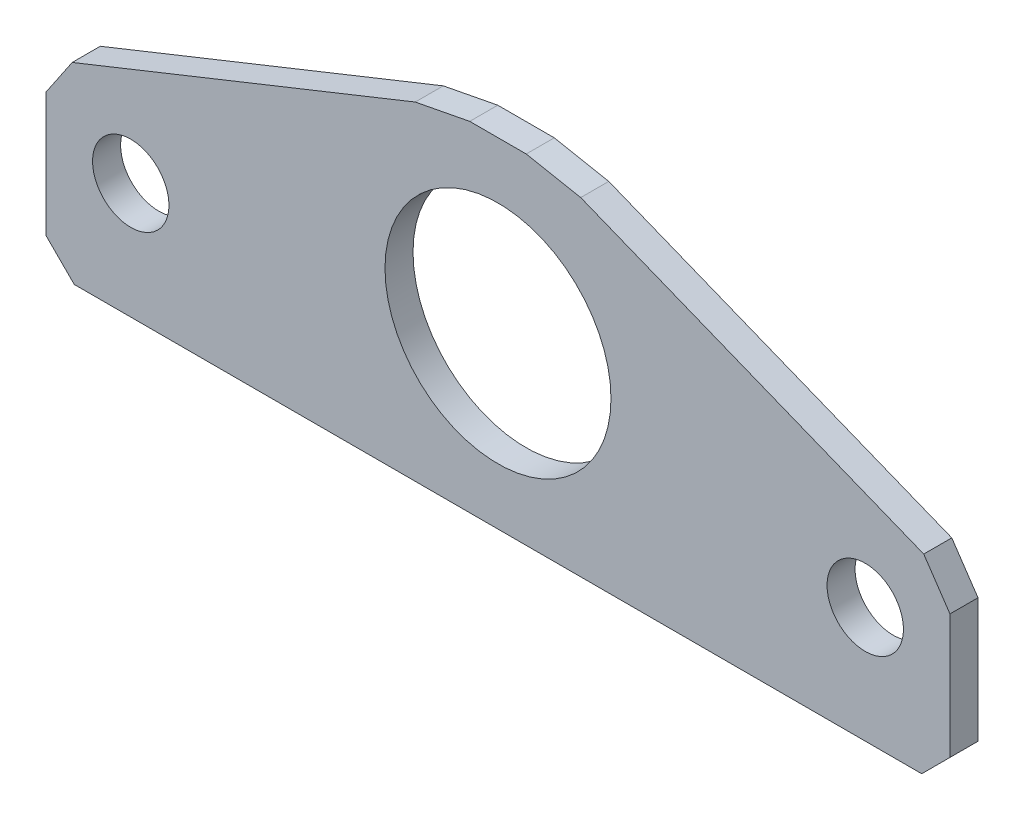
ISO-10303-21;
HEADER;
FILE_DESCRIPTION(('STEP AP214'),'2;1');
FILE_NAME('part.step','',(''),(''),'','','');
FILE_SCHEMA(('AUTOMOTIVE_DESIGN { 1 0 10303 214 1 1 1 1 }'));
ENDSEC;
DATA;
#1=APPLICATION_CONTEXT('core data for automotive mechanical design processes');
#2=APPLICATION_PROTOCOL_DEFINITION('international standard','automotive_design',2000,#1);
#3=PRODUCT_CONTEXT('',#1,'mechanical');
#4=PRODUCT('Part','Part','',(#3));
#5=PRODUCT_RELATED_PRODUCT_CATEGORY('part','',(#4));
#6=PRODUCT_DEFINITION_FORMATION('','',#4);
#7=PRODUCT_DEFINITION_CONTEXT('part definition',#1,'design');
#8=PRODUCT_DEFINITION('design','',#6,#7);
#9=PRODUCT_DEFINITION_SHAPE('','',#8);
#10=(LENGTH_UNIT() NAMED_UNIT(*) SI_UNIT(.MILLI.,.METRE.));
#11=(NAMED_UNIT(*) PLANE_ANGLE_UNIT() SI_UNIT($,.RADIAN.));
#12=(NAMED_UNIT(*) SI_UNIT($,.STERADIAN.) SOLID_ANGLE_UNIT());
#13=UNCERTAINTY_MEASURE_WITH_UNIT(LENGTH_MEASURE(1.E-05),#10,'distance_accuracy_value','');
#14=(GEOMETRIC_REPRESENTATION_CONTEXT(3) GLOBAL_UNCERTAINTY_ASSIGNED_CONTEXT((#13)) GLOBAL_UNIT_ASSIGNED_CONTEXT((#10,
#11,#12)) REPRESENTATION_CONTEXT('',''));
#15=CARTESIAN_POINT('',(0.,0.,0.));
#16=DIRECTION('',(0.,0.,1.));
#17=DIRECTION('',(1.,0.,0.));
#18=AXIS2_PLACEMENT_3D('',#15,#16,#17);
#19=CARTESIAN_POINT('',(25.4,20.955,1.5748));
#20=DIRECTION('',(0.,0.,-1.));
#21=DIRECTION('',(-1.,0.,0.));
#22=AXIS2_PLACEMENT_3D('',#19,#20,#21);
#23=PLANE('',#22);
#24=CARTESIAN_POINT('',(0.,0.,1.5748));
#25=DIRECTION('',(0.,0.,-1.));
#26=DIRECTION('',(-1.,0.,0.));
#27=AXIS2_PLACEMENT_3D('',#24,#25,#26);
#28=CIRCLE('',#27,6.35);
#29=CARTESIAN_POINT('',(-6.35,0.,1.5748));
#30=VERTEX_POINT('',#29);
#31=EDGE_CURVE('E137',#30,#30,#28,.T.);
#32=ORIENTED_EDGE('',*,*,#31,.T.);
#33=EDGE_LOOP('',(#32));
#34=FACE_BOUND('',#33,.T.);
#35=CARTESIAN_POINT('',(20.6375,-3.01285020999999,1.5748));
#36=DIRECTION('',(0.,0.,-1.));
#37=DIRECTION('',(-1.,0.,0.));
#38=AXIS2_PLACEMENT_3D('',#35,#36,#37);
#39=CIRCLE('',#38,2.1463);
#40=CARTESIAN_POINT('',(18.4912,-3.01285020999999,1.5748));
#41=VERTEX_POINT('',#40);
#42=EDGE_CURVE('E139',#41,#41,#39,.T.);
#43=ORIENTED_EDGE('',*,*,#42,.T.);
#44=EDGE_LOOP('',(#43));
#45=FACE_BOUND('',#44,.T.);
#46=DIRECTION('',(0.560628809305184,0.828067230469273,0.));
#47=VECTOR('',#46,1.);
#48=CARTESIAN_POINT('',(-25.4,-0.952500000000011,1.5748));
#49=LINE('',#48,#47);
#50=CARTESIAN_POINT('',(-23.9260432532196,1.22458269871215,1.5748));
#51=VERTEX_POINT('',#50);
#52=CARTESIAN_POINT('',(-25.4,-0.952500000000013,1.5748));
#53=VERTEX_POINT('',#52);
#54=EDGE_CURVE('E118',#51,#53,#49,.F.);
#55=ORIENTED_EDGE('',*,*,#54,.T.);
#56=DIRECTION('',(0.,1.,0.));
#57=VECTOR('',#56,1.);
#58=CARTESIAN_POINT('',(-25.4,0.635,1.5748));
#59=LINE('',#58,#57);
#60=CARTESIAN_POINT('',(-25.4,-7.9375,1.5748));
#61=VERTEX_POINT('',#60);
#62=EDGE_CURVE('E108',#53,#61,#59,.F.);
#63=ORIENTED_EDGE('',*,*,#62,.T.);
#64=DIRECTION('',(-0.707106781186547,0.707106781186548,0.));
#65=VECTOR('',#64,1.);
#66=CARTESIAN_POINT('',(-23.8125,-9.525,1.5748));
#67=LINE('',#66,#65);
#68=CARTESIAN_POINT('',(-23.8125,-9.525,1.5748));
#69=VERTEX_POINT('',#68);
#70=EDGE_CURVE('E141',#61,#69,#67,.F.);
#71=ORIENTED_EDGE('',*,*,#70,.T.);
#72=DIRECTION('',(-1.,0.,0.));
#73=VECTOR('',#72,1.);
#74=CARTESIAN_POINT('',(-25.4,-9.525,1.5748));
#75=LINE('',#74,#73);
#76=CARTESIAN_POINT('',(23.8125,-9.525,1.5748));
#77=VERTEX_POINT('',#76);
#78=EDGE_CURVE('E151',#69,#77,#75,.F.);
#79=ORIENTED_EDGE('',*,*,#78,.T.);
#80=DIRECTION('',(-0.707106781186547,-0.707106781186548,0.));
#81=VECTOR('',#80,1.);
#82=CARTESIAN_POINT('',(25.4,-7.93749999999999,1.5748));
#83=LINE('',#82,#81);
#84=CARTESIAN_POINT('',(25.4,-7.93749999999999,1.5748));
#85=VERTEX_POINT('',#84);
#86=EDGE_CURVE('E155',#77,#85,#83,.F.);
#87=ORIENTED_EDGE('',*,*,#86,.T.);
#88=DIRECTION('',(0.,-1.,0.));
#89=VECTOR('',#88,1.);
#90=CARTESIAN_POINT('',(25.4,0.635000000000006,1.5748));
#91=LINE('',#90,#89);
#92=CARTESIAN_POINT('',(25.4,-0.952500000000007,1.5748));
#93=VERTEX_POINT('',#92);
#94=EDGE_CURVE('E160',#85,#93,#91,.F.);
#95=ORIENTED_EDGE('',*,*,#94,.T.);
#96=DIRECTION('',(0.560628809305184,-0.828067230469273,0.));
#97=VECTOR('',#96,1.);
#98=CARTESIAN_POINT('',(23.9260432532196,1.22458269871215,1.5748));
#99=LINE('',#98,#97);
#100=CARTESIAN_POINT('',(23.9260432532196,1.22458269871215,1.5748));
#101=VERTEX_POINT('',#100);
#102=EDGE_CURVE('E165',#93,#101,#99,.F.);
#103=ORIENTED_EDGE('',*,*,#102,.T.);
#104=DIRECTION('',(0.928476690885259,-0.371390676354104,0.));
#105=VECTOR('',#104,1.);
#106=CARTESIAN_POINT('',(25.4,0.635000000000006,1.5748));
#107=LINE('',#106,#105);
#108=CARTESIAN_POINT('',(4.64895674678047,8.93541730128782,1.5748));
#109=VERTEX_POINT('',#108);
#110=EDGE_CURVE('E170',#101,#109,#107,.F.);
#111=ORIENTED_EDGE('',*,*,#110,.T.);
#112=DIRECTION('',(0.981956386731422,-0.189107521154951,0.));
#113=VECTOR('',#112,1.);
#114=CARTESIAN_POINT('',(1.58749999999997,9.525,1.5748));
#115=LINE('',#114,#113);
#116=CARTESIAN_POINT('',(1.58749999999986,9.525,1.5748));
#117=VERTEX_POINT('',#116);
#118=EDGE_CURVE('E175',#109,#117,#115,.F.);
#119=ORIENTED_EDGE('',*,*,#118,.T.);
#120=DIRECTION('',(1.,0.,0.));
#121=VECTOR('',#120,1.);
#122=CARTESIAN_POINT('',(-3.175,9.525,1.5748));
#123=LINE('',#122,#121);
#124=CARTESIAN_POINT('',(-1.58749999999997,9.525,1.5748));
#125=VERTEX_POINT('',#124);
#126=EDGE_CURVE('E180',#117,#125,#123,.F.);
#127=ORIENTED_EDGE('',*,*,#126,.T.);
#128=DIRECTION('',(0.981956386731422,0.189107521154951,0.));
#129=VECTOR('',#128,1.);
#130=CARTESIAN_POINT('',(-4.64895674678038,8.93541730128785,1.5748));
#131=LINE('',#130,#129);
#132=CARTESIAN_POINT('',(-4.64895674678053,8.93541730128779,1.5748));
#133=VERTEX_POINT('',#132);
#134=EDGE_CURVE('E185',#125,#133,#131,.F.);
#135=ORIENTED_EDGE('',*,*,#134,.T.);
#136=DIRECTION('',(0.928476690885259,0.371390676354104,0.));
#137=VECTOR('',#136,1.);
#138=CARTESIAN_POINT('',(-25.4,0.635,1.5748));
#139=LINE('',#138,#137);
#140=EDGE_CURVE('E103',#133,#51,#139,.F.);
#141=ORIENTED_EDGE('',*,*,#140,.T.);
#142=EDGE_LOOP('',(#55,#63,#71,#79,#87,#95,#103,#111,#119,#127,#135,#141));
#143=FACE_BOUND('',#142,.T.);
#144=CARTESIAN_POINT('',(-20.6375,-3.01285021,1.5748));
#145=DIRECTION('',(0.,0.,-1.));
#146=DIRECTION('',(-1.,0.,0.));
#147=AXIS2_PLACEMENT_3D('',#144,#145,#146);
#148=CIRCLE('',#147,2.1463);
#149=CARTESIAN_POINT('',(-22.7838,-3.01285021,1.5748));
#150=VERTEX_POINT('',#149);
#151=EDGE_CURVE('E20',#150,#150,#148,.T.);
#152=ORIENTED_EDGE('',*,*,#151,.T.);
#153=EDGE_LOOP('',(#152));
#154=FACE_BOUND('',#153,.T.);
#155=ADVANCED_FACE('F17',(#34,#45,#143,#154),#23,.F.);
#156=CARTESIAN_POINT('',(-20.6375,-3.01285021,1.5748));
#157=DIRECTION('',(0.,0.,-1.));
#158=DIRECTION('',(-1.,0.,0.));
#159=AXIS2_PLACEMENT_3D('',#156,#157,#158);
#160=CYLINDRICAL_SURFACE('',#159,2.1463);
#161=ORIENTED_EDGE('',*,*,#151,.F.);
#162=EDGE_LOOP('',(#161));
#163=FACE_BOUND('',#162,.T.);
#164=CARTESIAN_POINT('',(-20.6375,-3.01285021,0.));
#165=DIRECTION('',(0.,0.,-1.));
#166=DIRECTION('',(-1.,0.,0.));
#167=AXIS2_PLACEMENT_3D('',#164,#165,#166);
#168=CIRCLE('',#167,2.1463);
#169=CARTESIAN_POINT('',(-22.7838,-3.01285021,0.));
#170=VERTEX_POINT('',#169);
#171=EDGE_CURVE('E133',#170,#170,#168,.F.);
#172=ORIENTED_EDGE('',*,*,#171,.F.);
#173=EDGE_LOOP('',(#172));
#174=FACE_BOUND('',#173,.T.);
#175=ADVANCED_FACE('F261',(#163,#174),#160,.F.);
#176=CARTESIAN_POINT('',(-25.4,0.635,1.5748));
#177=DIRECTION('',(1.,0.,0.));
#178=DIRECTION('',(0.,0.,-1.));
#179=AXIS2_PLACEMENT_3D('',#176,#177,#178);
#180=PLANE('',#179);
#181=DIRECTION('',(0.,0.,1.));
#182=VECTOR('',#181,1.);
#183=CARTESIAN_POINT('',(-25.4,-0.952500000000011,1.5748));
#184=LINE('',#183,#182);
#185=CARTESIAN_POINT('',(-25.4,-0.952500000000016,0.));
#186=VERTEX_POINT('',#185);
#187=EDGE_CURVE('E111',#53,#186,#184,.F.);
#188=ORIENTED_EDGE('',*,*,#187,.T.);
#189=DIRECTION('',(0.,1.,0.));
#190=VECTOR('',#189,1.);
#191=CARTESIAN_POINT('',(-25.4,20.955,0.));
#192=LINE('',#191,#190);
#193=CARTESIAN_POINT('',(-25.4,-7.9375,0.));
#194=VERTEX_POINT('',#193);
#195=EDGE_CURVE('E136',#194,#186,#192,.T.);
#196=ORIENTED_EDGE('',*,*,#195,.F.);
#197=DIRECTION('',(0.,0.,1.));
#198=VECTOR('',#197,1.);
#199=CARTESIAN_POINT('',(-25.4,-7.9375,1.5748));
#200=LINE('',#199,#198);
#201=EDGE_CURVE('E114',#194,#61,#200,.T.);
#202=ORIENTED_EDGE('',*,*,#201,.T.);
#203=ORIENTED_EDGE('',*,*,#62,.F.);
#204=EDGE_LOOP('',(#188,#196,#202,#203));
#205=FACE_BOUND('',#204,.T.);
#206=ADVANCED_FACE('F109',(#205),#180,.F.);
#207=CARTESIAN_POINT('',(-25.4,-0.952500000000011,1.5748));
#208=DIRECTION('',(0.828067230469273,-0.560628809305184,0.));
#209=DIRECTION('',(0.560628809305184,0.828067230469273,0.));
#210=AXIS2_PLACEMENT_3D('',#207,#208,#209);
#211=PLANE('',#210);
#212=DIRECTION('',(0.,0.,1.));
#213=VECTOR('',#212,1.);
#214=CARTESIAN_POINT('',(-23.9260432532196,1.22458269871215,1.5748));
#215=LINE('',#214,#213);
#216=CARTESIAN_POINT('',(-23.9260432532196,1.22458269871215,0.));
#217=VERTEX_POINT('',#216);
#218=EDGE_CURVE('E189',#51,#217,#215,.F.);
#219=ORIENTED_EDGE('',*,*,#218,.T.);
#220=DIRECTION('',(0.560628809305186,0.828067230469271,0.));
#221=VECTOR('',#220,1.);
#222=CARTESIAN_POINT('',(-25.4,-0.952500000000016,0.));
#223=LINE('',#222,#221);
#224=EDGE_CURVE('E125',#186,#217,#223,.T.);
#225=ORIENTED_EDGE('',*,*,#224,.F.);
#226=ORIENTED_EDGE('',*,*,#187,.F.);
#227=ORIENTED_EDGE('',*,*,#54,.F.);
#228=EDGE_LOOP('',(#219,#225,#226,#227));
#229=FACE_BOUND('',#228,.T.);
#230=ADVANCED_FACE('F123',(#229),#211,.F.);
#231=CARTESIAN_POINT('',(-25.4,0.635,1.5748));
#232=DIRECTION('',(0.371390676354104,-0.928476690885259,0.));
#233=DIRECTION('',(0.928476690885259,0.371390676354104,0.));
#234=AXIS2_PLACEMENT_3D('',#231,#232,#233);
#235=PLANE('',#234);
#236=ORIENTED_EDGE('',*,*,#218,.F.);
#237=ORIENTED_EDGE('',*,*,#140,.F.);
#238=DIRECTION('',(0.,0.,1.));
#239=VECTOR('',#238,1.);
#240=CARTESIAN_POINT('',(-4.64895674678036,8.93541730128785,1.5748));
#241=LINE('',#240,#239);
#242=CARTESIAN_POINT('',(-4.6489567467806,8.93541730128777,0.));
#243=VERTEX_POINT('',#242);
#244=EDGE_CURVE('E187',#133,#243,#241,.F.);
#245=ORIENTED_EDGE('',*,*,#244,.T.);
#246=DIRECTION('',(0.928476690885259,0.371390676354105,0.));
#247=VECTOR('',#246,1.);
#248=CARTESIAN_POINT('',(-23.9260432532196,1.22458269871215,0.));
#249=LINE('',#248,#247);
#250=EDGE_CURVE('E193',#217,#243,#249,.T.);
#251=ORIENTED_EDGE('',*,*,#250,.F.);
#252=EDGE_LOOP('',(#236,#237,#245,#251));
#253=FACE_BOUND('',#252,.T.);
#254=ADVANCED_FACE('F194',(#253),#235,.F.);
#255=CARTESIAN_POINT('',(-4.64895674678038,8.93541730128785,1.5748));
#256=DIRECTION('',(0.189107521154951,-0.981956386731422,0.));
#257=DIRECTION('',(0.981956386731422,0.189107521154951,0.));
#258=AXIS2_PLACEMENT_3D('',#255,#256,#257);
#259=PLANE('',#258);
#260=DIRECTION('',(0.,0.,-1.));
#261=VECTOR('',#260,1.);
#262=CARTESIAN_POINT('',(-1.58749999999998,9.525,1.5748));
#263=LINE('',#262,#261);
#264=CARTESIAN_POINT('',(-1.58749999999997,9.525,0.));
#265=VERTEX_POINT('',#264);
#266=EDGE_CURVE('E183',#125,#265,#263,.T.);
#267=ORIENTED_EDGE('',*,*,#266,.T.);
#268=DIRECTION('',(0.98195638673142,0.189107521154962,0.));
#269=VECTOR('',#268,1.);
#270=CARTESIAN_POINT('',(-4.64895674678072,8.93541730128775,0.));
#271=LINE('',#270,#269);
#272=EDGE_CURVE('E199',#243,#265,#271,.T.);
#273=ORIENTED_EDGE('',*,*,#272,.F.);
#274=ORIENTED_EDGE('',*,*,#244,.F.);
#275=ORIENTED_EDGE('',*,*,#134,.F.);
#276=EDGE_LOOP('',(#267,#273,#274,#275));
#277=FACE_BOUND('',#276,.T.);
#278=ADVANCED_FACE('F277',(#277),#259,.F.);
#279=CARTESIAN_POINT('',(-3.175,9.525,1.5748));
#280=DIRECTION('',(0.,-1.,0.));
#281=DIRECTION('',(0.,0.,-1.));
#282=AXIS2_PLACEMENT_3D('',#279,#280,#281);
#283=PLANE('',#282);
#284=DIRECTION('',(0.,0.,1.));
#285=VECTOR('',#284,1.);
#286=CARTESIAN_POINT('',(1.58749999999994,9.52500000000001,1.5748));
#287=LINE('',#286,#285);
#288=CARTESIAN_POINT('',(1.58749999999984,9.525,0.));
#289=VERTEX_POINT('',#288);
#290=EDGE_CURVE('E178',#117,#289,#287,.F.);
#291=ORIENTED_EDGE('',*,*,#290,.T.);
#292=DIRECTION('',(-1.,0.,0.));
#293=VECTOR('',#292,1.);
#294=CARTESIAN_POINT('',(25.4,9.525,0.));
#295=LINE('',#294,#293);
#296=EDGE_CURVE('E207',#265,#289,#295,.F.);
#297=ORIENTED_EDGE('',*,*,#296,.F.);
#298=ORIENTED_EDGE('',*,*,#266,.F.);
#299=ORIENTED_EDGE('',*,*,#126,.F.);
#300=EDGE_LOOP('',(#291,#297,#298,#299));
#301=FACE_BOUND('',#300,.T.);
#302=ADVANCED_FACE('F280',(#301),#283,.F.);
#303=CARTESIAN_POINT('',(1.58749999999997,9.525,1.5748));
#304=DIRECTION('',(-0.189107521154951,-0.981956386731422,0.));
#305=DIRECTION('',(0.981956386731422,-0.189107521154951,0.));
#306=AXIS2_PLACEMENT_3D('',#303,#304,#305);
#307=PLANE('',#306);
#308=DIRECTION('',(0.,0.,1.));
#309=VECTOR('',#308,1.);
#310=CARTESIAN_POINT('',(4.64895674678057,8.93541730128778,1.5748));
#311=LINE('',#310,#309);
#312=CARTESIAN_POINT('',(4.64895674678042,8.93541730128784,0.));
#313=VERTEX_POINT('',#312);
#314=EDGE_CURVE('E173',#109,#313,#311,.F.);
#315=ORIENTED_EDGE('',*,*,#314,.T.);
#316=DIRECTION('',(0.981956386731423,-0.189107521154944,0.));
#317=VECTOR('',#316,1.);
#318=CARTESIAN_POINT('',(1.58749999999977,9.52500000000002,0.));
#319=LINE('',#318,#317);
#320=EDGE_CURVE('E210',#289,#313,#319,.T.);
#321=ORIENTED_EDGE('',*,*,#320,.F.);
#322=ORIENTED_EDGE('',*,*,#290,.F.);
#323=ORIENTED_EDGE('',*,*,#118,.F.);
#324=EDGE_LOOP('',(#315,#321,#322,#323));
#325=FACE_BOUND('',#324,.T.);
#326=ADVANCED_FACE('F284',(#325),#307,.F.);
#327=CARTESIAN_POINT('',(25.4,0.635000000000006,1.5748));
#328=DIRECTION('',(-0.371390676354104,-0.928476690885259,0.));
#329=DIRECTION('',(0.928476690885259,-0.371390676354104,0.));
#330=AXIS2_PLACEMENT_3D('',#327,#328,#329);
#331=PLANE('',#330);
#332=DIRECTION('',(0.,0.,1.));
#333=VECTOR('',#332,1.);
#334=CARTESIAN_POINT('',(23.9260432532196,1.22458269871215,1.5748));
#335=LINE('',#334,#333);
#336=CARTESIAN_POINT('',(23.9260432532196,1.22458269871215,0.));
#337=VERTEX_POINT('',#336);
#338=EDGE_CURVE('E168',#101,#337,#335,.F.);
#339=ORIENTED_EDGE('',*,*,#338,.T.);
#340=DIRECTION('',(0.928476690885259,-0.371390676354104,0.));
#341=VECTOR('',#340,1.);
#342=CARTESIAN_POINT('',(4.64895674678038,8.93541730128785,0.));
#343=LINE('',#342,#341);
#344=EDGE_CURVE('E213',#313,#337,#343,.T.);
#345=ORIENTED_EDGE('',*,*,#344,.F.);
#346=ORIENTED_EDGE('',*,*,#314,.F.);
#347=ORIENTED_EDGE('',*,*,#110,.F.);
#348=EDGE_LOOP('',(#339,#345,#346,#347));
#349=FACE_BOUND('',#348,.T.);
#350=ADVANCED_FACE('F288',(#349),#331,.F.);
#351=CARTESIAN_POINT('',(23.9260432532196,1.22458269871215,1.5748));
#352=DIRECTION('',(-0.828067230469273,-0.560628809305184,0.));
#353=DIRECTION('',(0.560628809305184,-0.828067230469273,0.));
#354=AXIS2_PLACEMENT_3D('',#351,#352,#353);
#355=PLANE('',#354);
#356=DIRECTION('',(0.,0.,1.));
#357=VECTOR('',#356,1.);
#358=CARTESIAN_POINT('',(25.4,-0.952500000000006,1.5748));
#359=LINE('',#358,#357);
#360=CARTESIAN_POINT('',(25.4,-0.952500000000007,0.));
#361=VERTEX_POINT('',#360);
#362=EDGE_CURVE('E163',#93,#361,#359,.F.);
#363=ORIENTED_EDGE('',*,*,#362,.T.);
#364=DIRECTION('',(0.560628809305184,-0.828067230469272,0.));
#365=VECTOR('',#364,1.);
#366=CARTESIAN_POINT('',(23.9260432532196,1.22458269871215,0.));
#367=LINE('',#366,#365);
#368=EDGE_CURVE('E216',#337,#361,#367,.T.);
#369=ORIENTED_EDGE('',*,*,#368,.F.);
#370=ORIENTED_EDGE('',*,*,#338,.F.);
#371=ORIENTED_EDGE('',*,*,#102,.F.);
#372=EDGE_LOOP('',(#363,#369,#370,#371));
#373=FACE_BOUND('',#372,.T.);
#374=ADVANCED_FACE('F292',(#373),#355,.F.);
#375=CARTESIAN_POINT('',(25.4,0.635000000000006,1.5748));
#376=DIRECTION('',(-1.,0.,0.));
#377=DIRECTION('',(0.,-1.,0.));
#378=AXIS2_PLACEMENT_3D('',#375,#376,#377);
#379=PLANE('',#378);
#380=DIRECTION('',(0.,0.,1.));
#381=VECTOR('',#380,1.);
#382=CARTESIAN_POINT('',(25.4,-7.93749999999999,1.5748));
#383=LINE('',#382,#381);
#384=CARTESIAN_POINT('',(25.4,-7.93749999999999,0.));
#385=VERTEX_POINT('',#384);
#386=EDGE_CURVE('E158',#85,#385,#383,.F.);
#387=ORIENTED_EDGE('',*,*,#386,.T.);
#388=DIRECTION('',(0.,1.,0.));
#389=VECTOR('',#388,1.);
#390=CARTESIAN_POINT('',(25.4,20.955,0.));
#391=LINE('',#390,#389);
#392=EDGE_CURVE('E219',#361,#385,#391,.F.);
#393=ORIENTED_EDGE('',*,*,#392,.F.);
#394=ORIENTED_EDGE('',*,*,#362,.F.);
#395=ORIENTED_EDGE('',*,*,#94,.F.);
#396=EDGE_LOOP('',(#387,#393,#394,#395));
#397=FACE_BOUND('',#396,.T.);
#398=ADVANCED_FACE('F296',(#397),#379,.F.);
#399=CARTESIAN_POINT('',(25.4,-7.93749999999999,1.5748));
#400=DIRECTION('',(-0.707106781186548,0.707106781186547,0.));
#401=DIRECTION('',(-0.707106781186547,-0.707106781186548,0.));
#402=AXIS2_PLACEMENT_3D('',#399,#400,#401);
#403=PLANE('',#402);
#404=DIRECTION('',(0.,0.,1.));
#405=VECTOR('',#404,1.);
#406=CARTESIAN_POINT('',(23.8125,-9.52499999999999,1.5748));
#407=LINE('',#406,#405);
#408=CARTESIAN_POINT('',(23.8125,-9.525,0.));
#409=VERTEX_POINT('',#408);
#410=EDGE_CURVE('E153',#77,#409,#407,.F.);
#411=ORIENTED_EDGE('',*,*,#410,.T.);
#412=DIRECTION('',(-0.707106781186546,-0.707106781186549,0.));
#413=VECTOR('',#412,1.);
#414=CARTESIAN_POINT('',(25.4,-7.93749999999999,0.));
#415=LINE('',#414,#413);
#416=EDGE_CURVE('E222',#385,#409,#415,.T.);
#417=ORIENTED_EDGE('',*,*,#416,.F.);
#418=ORIENTED_EDGE('',*,*,#386,.F.);
#419=ORIENTED_EDGE('',*,*,#86,.F.);
#420=EDGE_LOOP('',(#411,#417,#418,#419));
#421=FACE_BOUND('',#420,.T.);
#422=ADVANCED_FACE('F241',(#421),#403,.F.);
#423=CARTESIAN_POINT('',(-25.4,-9.525,1.5748));
#424=DIRECTION('',(0.,1.,0.));
#425=DIRECTION('',(-1.,0.,0.));
#426=AXIS2_PLACEMENT_3D('',#423,#424,#425);
#427=PLANE('',#426);
#428=DIRECTION('',(0.,0.,1.));
#429=VECTOR('',#428,1.);
#430=CARTESIAN_POINT('',(-23.8125,-9.525,1.5748));
#431=LINE('',#430,#429);
#432=CARTESIAN_POINT('',(-23.8125,-9.525,0.));
#433=VERTEX_POINT('',#432);
#434=EDGE_CURVE('E35',#69,#433,#431,.F.);
#435=ORIENTED_EDGE('',*,*,#434,.T.);
#436=DIRECTION('',(-1.,0.,0.));
#437=VECTOR('',#436,1.);
#438=CARTESIAN_POINT('',(25.4,-9.525,0.));
#439=LINE('',#438,#437);
#440=EDGE_CURVE('E225',#409,#433,#439,.T.);
#441=ORIENTED_EDGE('',*,*,#440,.F.);
#442=ORIENTED_EDGE('',*,*,#410,.F.);
#443=ORIENTED_EDGE('',*,*,#78,.F.);
#444=EDGE_LOOP('',(#435,#441,#442,#443));
#445=FACE_BOUND('',#444,.T.);
#446=ADVANCED_FACE('F231',(#445),#427,.F.);
#447=CARTESIAN_POINT('',(-23.8125,-9.525,1.5748));
#448=DIRECTION('',(0.707106781186548,0.707106781186547,0.));
#449=DIRECTION('',(-0.707106781186547,0.707106781186548,0.));
#450=AXIS2_PLACEMENT_3D('',#447,#448,#449);
#451=PLANE('',#450);
#452=ORIENTED_EDGE('',*,*,#201,.F.);
#453=DIRECTION('',(-0.707106781186544,0.707106781186551,0.));
#454=VECTOR('',#453,1.);
#455=CARTESIAN_POINT('',(-23.8125,-9.525,0.));
#456=LINE('',#455,#454);
#457=EDGE_CURVE('E132',#433,#194,#456,.T.);
#458=ORIENTED_EDGE('',*,*,#457,.F.);
#459=ORIENTED_EDGE('',*,*,#434,.F.);
#460=ORIENTED_EDGE('',*,*,#70,.F.);
#461=EDGE_LOOP('',(#452,#458,#459,#460));
#462=FACE_BOUND('',#461,.T.);
#463=ADVANCED_FACE('F228',(#462),#451,.F.);
#464=CARTESIAN_POINT('',(20.6375,-3.01285020999999,1.5748));
#465=DIRECTION('',(0.,0.,-1.));
#466=DIRECTION('',(-1.,0.,0.));
#467=AXIS2_PLACEMENT_3D('',#464,#465,#466);
#468=CYLINDRICAL_SURFACE('',#467,2.1463);
#469=ORIENTED_EDGE('',*,*,#42,.F.);
#470=EDGE_LOOP('',(#469));
#471=FACE_BOUND('',#470,.T.);
#472=CARTESIAN_POINT('',(20.6375,-3.01285020999999,0.));
#473=DIRECTION('',(0.,0.,-1.));
#474=DIRECTION('',(-1.,0.,0.));
#475=AXIS2_PLACEMENT_3D('',#472,#473,#474);
#476=CIRCLE('',#475,2.1463);
#477=CARTESIAN_POINT('',(18.4912,-3.01285020999999,0.));
#478=VERTEX_POINT('',#477);
#479=EDGE_CURVE('E26',#478,#478,#476,.F.);
#480=ORIENTED_EDGE('',*,*,#479,.F.);
#481=EDGE_LOOP('',(#480));
#482=FACE_BOUND('',#481,.T.);
#483=ADVANCED_FACE('F230',(#471,#482),#468,.F.);
#484=CARTESIAN_POINT('',(0.,0.,1.5748));
#485=DIRECTION('',(0.,0.,-1.));
#486=DIRECTION('',(-1.,0.,0.));
#487=AXIS2_PLACEMENT_3D('',#484,#485,#486);
#488=CYLINDRICAL_SURFACE('',#487,6.35);
#489=ORIENTED_EDGE('',*,*,#31,.F.);
#490=EDGE_LOOP('',(#489));
#491=FACE_BOUND('',#490,.T.);
#492=CARTESIAN_POINT('',(0.,0.,0.));
#493=DIRECTION('',(0.,0.,-1.));
#494=DIRECTION('',(-1.,0.,0.));
#495=AXIS2_PLACEMENT_3D('',#492,#493,#494);
#496=CIRCLE('',#495,6.35);
#497=CARTESIAN_POINT('',(-6.35,0.,0.));
#498=VERTEX_POINT('',#497);
#499=EDGE_CURVE('E11',#498,#498,#496,.F.);
#500=ORIENTED_EDGE('',*,*,#499,.F.);
#501=EDGE_LOOP('',(#500));
#502=FACE_BOUND('',#501,.T.);
#503=ADVANCED_FACE('F238',(#491,#502),#488,.F.);
#504=CARTESIAN_POINT('',(25.4,20.955,0.));
#505=DIRECTION('',(0.,0.,-1.));
#506=DIRECTION('',(-1.,0.,0.));
#507=AXIS2_PLACEMENT_3D('',#504,#505,#506);
#508=PLANE('',#507);
#509=ORIENTED_EDGE('',*,*,#499,.T.);
#510=EDGE_LOOP('',(#509));
#511=FACE_BOUND('',#510,.T.);
#512=ORIENTED_EDGE('',*,*,#479,.T.);
#513=EDGE_LOOP('',(#512));
#514=FACE_BOUND('',#513,.T.);
#515=ORIENTED_EDGE('',*,*,#440,.T.);
#516=ORIENTED_EDGE('',*,*,#457,.T.);
#517=ORIENTED_EDGE('',*,*,#195,.T.);
#518=ORIENTED_EDGE('',*,*,#224,.T.);
#519=ORIENTED_EDGE('',*,*,#250,.T.);
#520=ORIENTED_EDGE('',*,*,#272,.T.);
#521=ORIENTED_EDGE('',*,*,#296,.T.);
#522=ORIENTED_EDGE('',*,*,#320,.T.);
#523=ORIENTED_EDGE('',*,*,#344,.T.);
#524=ORIENTED_EDGE('',*,*,#368,.T.);
#525=ORIENTED_EDGE('',*,*,#392,.T.);
#526=ORIENTED_EDGE('',*,*,#416,.T.);
#527=EDGE_LOOP('',(#515,#516,#517,#518,#519,#520,#521,#522,#523,#524,#525,#526));
#528=FACE_BOUND('',#527,.T.);
#529=ORIENTED_EDGE('',*,*,#171,.T.);
#530=EDGE_LOOP('',(#529));
#531=FACE_BOUND('',#530,.T.);
#532=ADVANCED_FACE('F202',(#511,#514,#528,#531),#508,.T.);
#533=CLOSED_SHELL('',(#155,#175,#206,#230,#254,#278,#302,#326,#350,#374,#398,#422,#446,#463,
#483,#503,#532));
#534=MANIFOLD_SOLID_BREP('B1',#533);
#535=ADVANCED_BREP_SHAPE_REPRESENTATION('',(#18,#534),#14);
#536=SHAPE_DEFINITION_REPRESENTATION(#9,#535);
ENDSEC;
END-ISO-10303-21;
